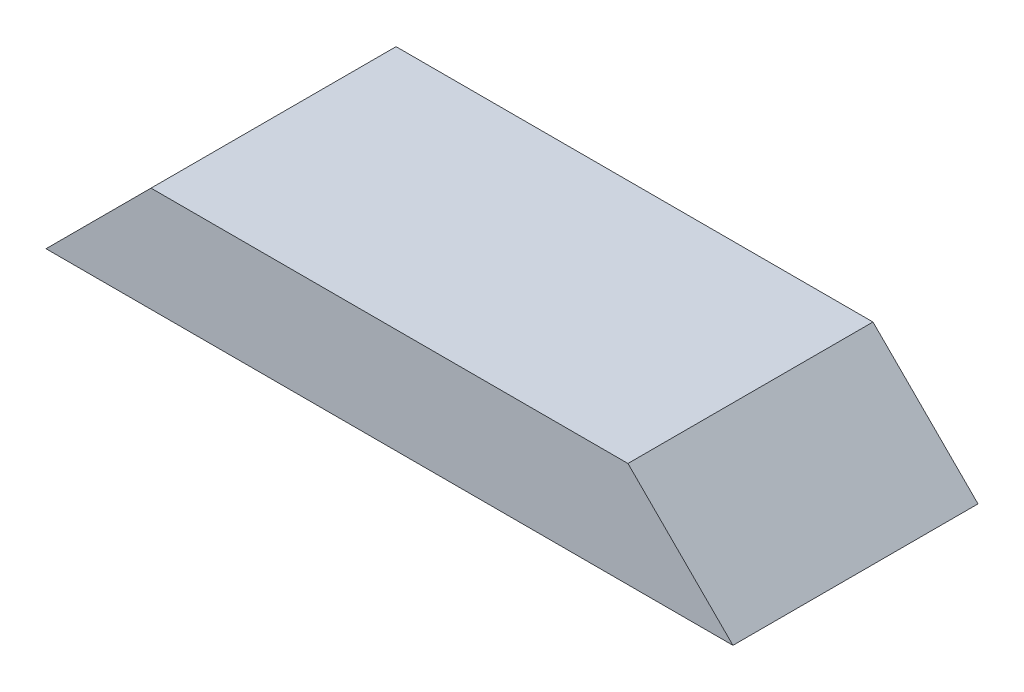
ISO-10303-21;
HEADER;
FILE_DESCRIPTION(('STEP AP214'),'2;1');
FILE_NAME('part.step','',(''),(''),'','','');
FILE_SCHEMA(('AUTOMOTIVE_DESIGN { 1 0 10303 214 1 1 1 1 }'));
ENDSEC;
DATA;
#1=APPLICATION_CONTEXT('core data for automotive mechanical design processes');
#2=APPLICATION_PROTOCOL_DEFINITION('international standard','automotive_design',2000,#1);
#3=PRODUCT_CONTEXT('',#1,'mechanical');
#4=PRODUCT('Part','Part','',(#3));
#5=PRODUCT_RELATED_PRODUCT_CATEGORY('part','',(#4));
#6=PRODUCT_DEFINITION_FORMATION('','',#4);
#7=PRODUCT_DEFINITION_CONTEXT('part definition',#1,'design');
#8=PRODUCT_DEFINITION('design','',#6,#7);
#9=PRODUCT_DEFINITION_SHAPE('','',#8);
#10=(LENGTH_UNIT() NAMED_UNIT(*) SI_UNIT(.MILLI.,.METRE.));
#11=(NAMED_UNIT(*) PLANE_ANGLE_UNIT() SI_UNIT($,.RADIAN.));
#12=(NAMED_UNIT(*) SI_UNIT($,.STERADIAN.) SOLID_ANGLE_UNIT());
#13=UNCERTAINTY_MEASURE_WITH_UNIT(LENGTH_MEASURE(1.E-05),#10,'distance_accuracy_value','');
#14=(GEOMETRIC_REPRESENTATION_CONTEXT(3) GLOBAL_UNCERTAINTY_ASSIGNED_CONTEXT((#13)) GLOBAL_UNIT_ASSIGNED_CONTEXT((#10,
#11,#12)) REPRESENTATION_CONTEXT('',''));
#15=CARTESIAN_POINT('',(0.,0.,0.));
#16=DIRECTION('',(0.,0.,1.));
#17=DIRECTION('',(1.,0.,0.));
#18=AXIS2_PLACEMENT_3D('',#15,#16,#17);
#19=CARTESIAN_POINT('',(0.,38.1,0.));
#20=DIRECTION('',(0.,0.,-1.));
#21=DIRECTION('',(-1.,0.,0.));
#22=AXIS2_PLACEMENT_3D('',#19,#20,#21);
#23=PLANE('',#22);
#24=DIRECTION('',(1.,0.,0.));
#25=VECTOR('',#24,1.);
#26=CARTESIAN_POINT('',(0.,38.1,0.));
#27=LINE('',#26,#25);
#28=CARTESIAN_POINT('',(38.1,38.1,0.));
#29=VERTEX_POINT('',#28);
#30=CARTESIAN_POINT('',(211.1375,38.1,0.));
#31=VERTEX_POINT('',#30);
#32=EDGE_CURVE('E46',#29,#31,#27,.T.);
#33=ORIENTED_EDGE('',*,*,#32,.F.);
#34=DIRECTION('',(0.707106781186547,0.707106781186547,0.));
#35=VECTOR('',#34,1.);
#36=CARTESIAN_POINT('',(0.,0.,0.));
#37=LINE('',#36,#35);
#38=CARTESIAN_POINT('',(0.,0.,0.));
#39=VERTEX_POINT('',#38);
#40=EDGE_CURVE('E81',#39,#29,#37,.T.);
#41=ORIENTED_EDGE('',*,*,#40,.F.);
#42=DIRECTION('',(1.,0.,0.));
#43=VECTOR('',#42,1.);
#44=CARTESIAN_POINT('',(0.,0.,0.));
#45=LINE('',#44,#43);
#46=CARTESIAN_POINT('',(249.2375,0.,0.));
#47=VERTEX_POINT('',#46);
#48=EDGE_CURVE('E86',#39,#47,#45,.T.);
#49=ORIENTED_EDGE('',*,*,#48,.T.);
#50=DIRECTION('',(0.707106781186548,-0.707106781186547,0.));
#51=VECTOR('',#50,1.);
#52=CARTESIAN_POINT('',(211.1375,38.1,0.));
#53=LINE('',#52,#51);
#54=EDGE_CURVE('E62',#31,#47,#53,.T.);
#55=ORIENTED_EDGE('',*,*,#54,.F.);
#56=EDGE_LOOP('',(#33,#41,#49,#55));
#57=FACE_BOUND('',#56,.T.);
#58=ADVANCED_FACE('F38',(#57),#23,.F.);
#59=CARTESIAN_POINT('',(0.,38.1,-88.9));
#60=DIRECTION('',(0.,0.,1.));
#61=DIRECTION('',(1.,0.,0.));
#62=AXIS2_PLACEMENT_3D('',#59,#60,#61);
#63=PLANE('',#62);
#64=DIRECTION('',(-1.,0.,0.));
#65=VECTOR('',#64,1.);
#66=CARTESIAN_POINT('',(0.,0.,-88.9));
#67=LINE('',#66,#65);
#68=CARTESIAN_POINT('',(249.2375,0.,-88.9));
#69=VERTEX_POINT('',#68);
#70=CARTESIAN_POINT('',(0.,0.,-88.9));
#71=VERTEX_POINT('',#70);
#72=EDGE_CURVE('E41',#69,#71,#67,.T.);
#73=ORIENTED_EDGE('',*,*,#72,.T.);
#74=DIRECTION('',(0.707106781186547,0.707106781186547,0.));
#75=VECTOR('',#74,1.);
#76=CARTESIAN_POINT('',(0.,0.,-88.9));
#77=LINE('',#76,#75);
#78=CARTESIAN_POINT('',(38.1,38.1,-88.9));
#79=VERTEX_POINT('',#78);
#80=EDGE_CURVE('E54',#71,#79,#77,.T.);
#81=ORIENTED_EDGE('',*,*,#80,.T.);
#82=DIRECTION('',(-1.,0.,0.));
#83=VECTOR('',#82,1.);
#84=CARTESIAN_POINT('',(0.,38.1,-88.9));
#85=LINE('',#84,#83);
#86=CARTESIAN_POINT('',(211.1375,38.1,-88.9));
#87=VERTEX_POINT('',#86);
#88=EDGE_CURVE('E11',#87,#79,#85,.T.);
#89=ORIENTED_EDGE('',*,*,#88,.F.);
#90=DIRECTION('',(0.707106781186548,-0.707106781186547,0.));
#91=VECTOR('',#90,1.);
#92=CARTESIAN_POINT('',(211.1375,38.1,-88.9));
#93=LINE('',#92,#91);
#94=EDGE_CURVE('E99',#87,#69,#93,.T.);
#95=ORIENTED_EDGE('',*,*,#94,.T.);
#96=EDGE_LOOP('',(#73,#81,#89,#95));
#97=FACE_BOUND('',#96,.T.);
#98=ADVANCED_FACE('F108',(#97),#63,.F.);
#99=CARTESIAN_POINT('',(0.,38.1,0.));
#100=DIRECTION('',(0.,-1.,0.));
#101=DIRECTION('',(0.,0.,-1.));
#102=AXIS2_PLACEMENT_3D('',#99,#100,#101);
#103=PLANE('',#102);
#104=ORIENTED_EDGE('',*,*,#88,.T.);
#105=DIRECTION('',(0.,0.,1.));
#106=VECTOR('',#105,1.);
#107=CARTESIAN_POINT('',(38.1,38.1,-88.9));
#108=LINE('',#107,#106);
#109=EDGE_CURVE('E87',#79,#29,#108,.T.);
#110=ORIENTED_EDGE('',*,*,#109,.T.);
#111=ORIENTED_EDGE('',*,*,#32,.T.);
#112=DIRECTION('',(0.,0.,1.));
#113=VECTOR('',#112,1.);
#114=CARTESIAN_POINT('',(211.1375,38.1,-88.9));
#115=LINE('',#114,#113);
#116=EDGE_CURVE('E102',#87,#31,#115,.T.);
#117=ORIENTED_EDGE('',*,*,#116,.F.);
#118=EDGE_LOOP('',(#104,#110,#111,#117));
#119=FACE_BOUND('',#118,.T.);
#120=ADVANCED_FACE('F111',(#119),#103,.F.);
#121=CARTESIAN_POINT('',(0.,0.,0.));
#122=DIRECTION('',(0.,-1.,0.));
#123=DIRECTION('',(0.,0.,-1.));
#124=AXIS2_PLACEMENT_3D('',#121,#122,#123);
#125=PLANE('',#124);
#126=DIRECTION('',(0.,0.,1.));
#127=VECTOR('',#126,1.);
#128=CARTESIAN_POINT('',(0.,0.,0.));
#129=LINE('',#128,#127);
#130=EDGE_CURVE('E78',#71,#39,#129,.T.);
#131=ORIENTED_EDGE('',*,*,#130,.F.);
#132=ORIENTED_EDGE('',*,*,#72,.F.);
#133=DIRECTION('',(0.,0.,-1.));
#134=VECTOR('',#133,1.);
#135=CARTESIAN_POINT('',(249.2375,0.,0.));
#136=LINE('',#135,#134);
#137=EDGE_CURVE('E95',#47,#69,#136,.T.);
#138=ORIENTED_EDGE('',*,*,#137,.F.);
#139=ORIENTED_EDGE('',*,*,#48,.F.);
#140=EDGE_LOOP('',(#131,#132,#138,#139));
#141=FACE_BOUND('',#140,.T.);
#142=ADVANCED_FACE('F94',(#141),#125,.T.);
#143=CARTESIAN_POINT('',(211.1375,38.1,-88.9));
#144=DIRECTION('',(-0.707106781186547,-0.707106781186548,0.));
#145=DIRECTION('',(0.707106781186548,-0.707106781186547,0.));
#146=AXIS2_PLACEMENT_3D('',#143,#144,#145);
#147=PLANE('',#146);
#148=ORIENTED_EDGE('',*,*,#54,.T.);
#149=ORIENTED_EDGE('',*,*,#137,.T.);
#150=ORIENTED_EDGE('',*,*,#94,.F.);
#151=ORIENTED_EDGE('',*,*,#116,.T.);
#152=EDGE_LOOP('',(#148,#149,#150,#151));
#153=FACE_BOUND('',#152,.T.);
#154=ADVANCED_FACE('F112',(#153),#147,.F.);
#155=CARTESIAN_POINT('',(0.,0.,-88.9));
#156=DIRECTION('',(0.707106781186547,-0.707106781186547,0.));
#157=DIRECTION('',(0.707106781186548,0.707106781186548,0.));
#158=AXIS2_PLACEMENT_3D('',#155,#156,#157);
#159=PLANE('',#158);
#160=ORIENTED_EDGE('',*,*,#40,.T.);
#161=ORIENTED_EDGE('',*,*,#109,.F.);
#162=ORIENTED_EDGE('',*,*,#80,.F.);
#163=ORIENTED_EDGE('',*,*,#130,.T.);
#164=EDGE_LOOP('',(#160,#161,#162,#163));
#165=FACE_BOUND('',#164,.T.);
#166=ADVANCED_FACE('F80',(#165),#159,.F.);
#167=CLOSED_SHELL('',(#58,#98,#120,#142,#154,#166));
#168=MANIFOLD_SOLID_BREP('B2',#167);
#169=ADVANCED_BREP_SHAPE_REPRESENTATION('',(#18,#168),#14);
#170=SHAPE_DEFINITION_REPRESENTATION(#9,#169);
ENDSEC;
END-ISO-10303-21;
